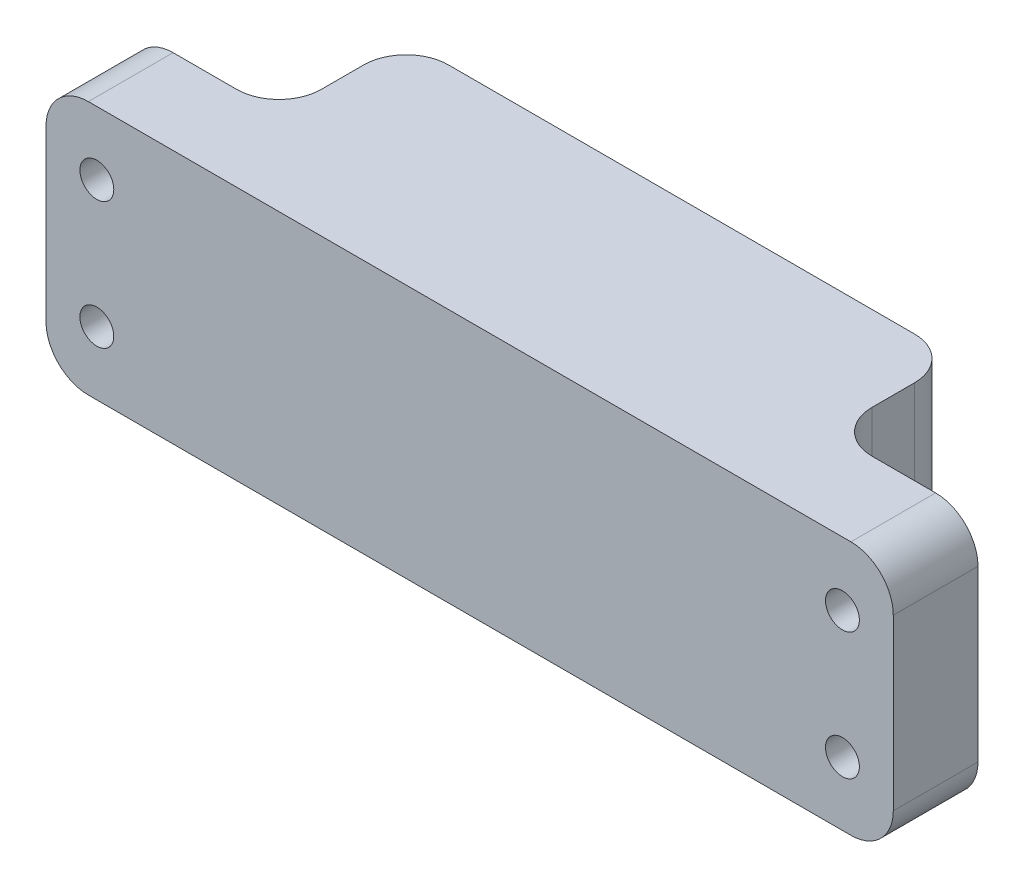
ISO-10303-21;
HEADER;
FILE_DESCRIPTION(('STEP AP214'),'2;1');
FILE_NAME('part.step','',(''),(''),'','','');
FILE_SCHEMA(('AUTOMOTIVE_DESIGN { 1 0 10303 214 1 1 1 1 }'));
ENDSEC;
DATA;
#1=APPLICATION_CONTEXT('core data for automotive mechanical design processes');
#2=APPLICATION_PROTOCOL_DEFINITION('international standard','automotive_design',2000,#1);
#3=PRODUCT_CONTEXT('',#1,'mechanical');
#4=PRODUCT('Part','Part','',(#3));
#5=PRODUCT_RELATED_PRODUCT_CATEGORY('part','',(#4));
#6=PRODUCT_DEFINITION_FORMATION('','',#4);
#7=PRODUCT_DEFINITION_CONTEXT('part definition',#1,'design');
#8=PRODUCT_DEFINITION('design','',#6,#7);
#9=PRODUCT_DEFINITION_SHAPE('','',#8);
#10=(LENGTH_UNIT() NAMED_UNIT(*) SI_UNIT(.MILLI.,.METRE.));
#11=(NAMED_UNIT(*) PLANE_ANGLE_UNIT() SI_UNIT($,.RADIAN.));
#12=(NAMED_UNIT(*) SI_UNIT($,.STERADIAN.) SOLID_ANGLE_UNIT());
#13=UNCERTAINTY_MEASURE_WITH_UNIT(LENGTH_MEASURE(1.E-05),#10,'distance_accuracy_value','');
#14=(GEOMETRIC_REPRESENTATION_CONTEXT(3) GLOBAL_UNCERTAINTY_ASSIGNED_CONTEXT((#13)) GLOBAL_UNIT_ASSIGNED_CONTEXT((#10,
#11,#12)) REPRESENTATION_CONTEXT('',''));
#15=CARTESIAN_POINT('',(0.,0.,0.));
#16=DIRECTION('',(0.,0.,1.));
#17=DIRECTION('',(1.,0.,0.));
#18=AXIS2_PLACEMENT_3D('',#15,#16,#17);
#19=CARTESIAN_POINT('',(88.,45.,25.0000000000001));
#20=DIRECTION('',(0.,0.,-1.));
#21=DIRECTION('',(-1.,0.,0.));
#22=AXIS2_PLACEMENT_3D('',#19,#20,#21);
#23=CYLINDRICAL_SURFACE('',#22,4.00000000000001);
#24=CARTESIAN_POINT('',(88.,45.,25.0000000000001));
#25=DIRECTION('',(0.,0.,-1.));
#26=DIRECTION('',(-1.,0.,0.));
#27=AXIS2_PLACEMENT_3D('',#24,#25,#26);
#28=CIRCLE('',#27,4.00000000000001);
#29=CARTESIAN_POINT('',(84.,45.,25.0000000000001));
#30=VERTEX_POINT('',#29);
#31=EDGE_CURVE('E297',#30,#30,#28,.T.);
#32=ORIENTED_EDGE('',*,*,#31,.F.);
#33=EDGE_LOOP('',(#32));
#34=FACE_BOUND('',#33,.T.);
#35=CARTESIAN_POINT('',(88.,45.,15.));
#36=DIRECTION('',(0.,0.,-1.));
#37=DIRECTION('',(-1.,0.,0.));
#38=AXIS2_PLACEMENT_3D('',#35,#36,#37);
#39=CIRCLE('',#38,4.00000000000001);
#40=CARTESIAN_POINT('',(84.,45.,15.));
#41=VERTEX_POINT('',#40);
#42=EDGE_CURVE('E637',#41,#41,#39,.T.);
#43=ORIENTED_EDGE('',*,*,#42,.T.);
#44=EDGE_LOOP('',(#43));
#45=FACE_BOUND('',#44,.T.);
#46=ADVANCED_FACE('F50',(#34,#45),#23,.F.);
#47=CARTESIAN_POINT('',(88.,15.,25.0000000000001));
#48=DIRECTION('',(0.,0.,-1.));
#49=DIRECTION('',(-1.,0.,0.));
#50=AXIS2_PLACEMENT_3D('',#47,#48,#49);
#51=CYLINDRICAL_SURFACE('',#50,4.00000000000001);
#52=CARTESIAN_POINT('',(88.,15.,25.0000000000001));
#53=DIRECTION('',(0.,0.,-1.));
#54=DIRECTION('',(1.,0.,0.));
#55=AXIS2_PLACEMENT_3D('',#52,#53,#54);
#56=CIRCLE('',#55,4.00000000000001);
#57=CARTESIAN_POINT('',(92.,15.,25.0000000000001));
#58=VERTEX_POINT('',#57);
#59=EDGE_CURVE('E687',#58,#58,#56,.T.);
#60=ORIENTED_EDGE('',*,*,#59,.F.);
#61=EDGE_LOOP('',(#60));
#62=FACE_BOUND('',#61,.T.);
#63=CARTESIAN_POINT('',(88.,15.,15.));
#64=DIRECTION('',(0.,0.,-1.));
#65=DIRECTION('',(-1.,0.,0.));
#66=AXIS2_PLACEMENT_3D('',#63,#64,#65);
#67=CIRCLE('',#66,4.00000000000001);
#68=CARTESIAN_POINT('',(84.,15.,15.));
#69=VERTEX_POINT('',#68);
#70=EDGE_CURVE('E660',#69,#69,#67,.T.);
#71=ORIENTED_EDGE('',*,*,#70,.T.);
#72=EDGE_LOOP('',(#71));
#73=FACE_BOUND('',#72,.T.);
#74=ADVANCED_FACE('F384',(#62,#73),#51,.F.);
#75=CARTESIAN_POINT('',(-88.,15.,25.));
#76=DIRECTION('',(0.,0.,-1.));
#77=DIRECTION('',(-1.,0.,0.));
#78=AXIS2_PLACEMENT_3D('',#75,#76,#77);
#79=CYLINDRICAL_SURFACE('',#78,4.00000000000001);
#80=CARTESIAN_POINT('',(-88.,15.,25.));
#81=DIRECTION('',(0.,0.,-1.));
#82=DIRECTION('',(-1.,0.,0.));
#83=AXIS2_PLACEMENT_3D('',#80,#81,#82);
#84=CIRCLE('',#83,4.00000000000001);
#85=CARTESIAN_POINT('',(-92.,15.,25.));
#86=VERTEX_POINT('',#85);
#87=EDGE_CURVE('E691',#86,#86,#84,.T.);
#88=ORIENTED_EDGE('',*,*,#87,.F.);
#89=EDGE_LOOP('',(#88));
#90=FACE_BOUND('',#89,.T.);
#91=CARTESIAN_POINT('',(-88.,15.,15.));
#92=DIRECTION('',(0.,0.,-1.));
#93=DIRECTION('',(-1.,0.,0.));
#94=AXIS2_PLACEMENT_3D('',#91,#92,#93);
#95=CIRCLE('',#94,4.00000000000001);
#96=CARTESIAN_POINT('',(-92.,15.,15.));
#97=VERTEX_POINT('',#96);
#98=EDGE_CURVE('E664',#97,#97,#95,.T.);
#99=ORIENTED_EDGE('',*,*,#98,.T.);
#100=EDGE_LOOP('',(#99));
#101=FACE_BOUND('',#100,.T.);
#102=ADVANCED_FACE('F390',(#90,#101),#79,.F.);
#103=CARTESIAN_POINT('',(-88.,45.,25.));
#104=DIRECTION('',(0.,0.,-1.));
#105=DIRECTION('',(-1.,0.,0.));
#106=AXIS2_PLACEMENT_3D('',#103,#104,#105);
#107=CYLINDRICAL_SURFACE('',#106,4.00000000000001);
#108=CARTESIAN_POINT('',(-88.,45.,25.));
#109=DIRECTION('',(0.,0.,-1.));
#110=DIRECTION('',(1.,0.,0.));
#111=AXIS2_PLACEMENT_3D('',#108,#109,#110);
#112=CIRCLE('',#111,4.00000000000001);
#113=CARTESIAN_POINT('',(-84.,45.,25.));
#114=VERTEX_POINT('',#113);
#115=EDGE_CURVE('E683',#114,#114,#112,.T.);
#116=ORIENTED_EDGE('',*,*,#115,.F.);
#117=EDGE_LOOP('',(#116));
#118=FACE_BOUND('',#117,.T.);
#119=CARTESIAN_POINT('',(-88.,45.,15.));
#120=DIRECTION('',(0.,0.,-1.));
#121=DIRECTION('',(-1.,0.,0.));
#122=AXIS2_PLACEMENT_3D('',#119,#120,#121);
#123=CIRCLE('',#122,4.00000000000001);
#124=CARTESIAN_POINT('',(-92.,45.,15.));
#125=VERTEX_POINT('',#124);
#126=EDGE_CURVE('E655',#125,#125,#123,.T.);
#127=ORIENTED_EDGE('',*,*,#126,.T.);
#128=EDGE_LOOP('',(#127));
#129=FACE_BOUND('',#128,.T.);
#130=ADVANCED_FACE('F397',(#118,#129),#107,.F.);
#131=CARTESIAN_POINT('',(0.,60.,4.99999999999995));
#132=DIRECTION('',(0.,0.,-1.));
#133=DIRECTION('',(-1.,0.,0.));
#134=AXIS2_PLACEMENT_3D('',#131,#132,#133);
#135=PLANE('',#134);
#136=CARTESIAN_POINT('',(88.,15.,4.99999999999999));
#137=DIRECTION('',(0.,0.,-1.));
#138=DIRECTION('',(-1.,0.,0.));
#139=AXIS2_PLACEMENT_3D('',#136,#137,#138);
#140=CIRCLE('',#139,6.00000000000001);
#141=CARTESIAN_POINT('',(82.,15.,4.99999999999999));
#142=VERTEX_POINT('',#141);
#143=EDGE_CURVE('E665',#142,#142,#140,.T.);
#144=ORIENTED_EDGE('',*,*,#143,.F.);
#145=EDGE_LOOP('',(#144));
#146=FACE_BOUND('',#145,.T.);
#147=CARTESIAN_POINT('',(88.,45.,4.99999999999999));
#148=DIRECTION('',(0.,0.,-1.));
#149=DIRECTION('',(-1.,0.,0.));
#150=AXIS2_PLACEMENT_3D('',#147,#148,#149);
#151=CIRCLE('',#150,6.00000000000001);
#152=CARTESIAN_POINT('',(82.,45.,4.99999999999999));
#153=VERTEX_POINT('',#152);
#154=EDGE_CURVE('E642',#153,#153,#151,.T.);
#155=ORIENTED_EDGE('',*,*,#154,.F.);
#156=EDGE_LOOP('',(#155));
#157=FACE_BOUND('',#156,.T.);
#158=DIRECTION('',(0.,-1.,0.));
#159=VECTOR('',#158,1.);
#160=CARTESIAN_POINT('',(100.,60.,4.99999999999998));
#161=LINE('',#160,#159);
#162=CARTESIAN_POINT('',(100.,50.,4.99999999999998));
#163=VERTEX_POINT('',#162);
#164=CARTESIAN_POINT('',(100.,10.,4.99999999999998));
#165=VERTEX_POINT('',#164);
#166=EDGE_CURVE('E332',#163,#165,#161,.T.);
#167=ORIENTED_EDGE('',*,*,#166,.T.);
#168=CARTESIAN_POINT('',(90.,10.,4.99999999999999));
#169=DIRECTION('',(0.,0.,-1.));
#170=DIRECTION('',(-1.,0.,0.));
#171=AXIS2_PLACEMENT_3D('',#168,#169,#170);
#172=CIRCLE('',#171,10.);
#173=CARTESIAN_POINT('',(90.,0.,4.99999999999999));
#174=VERTEX_POINT('',#173);
#175=EDGE_CURVE('E66',#165,#174,#172,.T.);
#176=ORIENTED_EDGE('',*,*,#175,.T.);
#177=DIRECTION('',(1.,0.,0.));
#178=VECTOR('',#177,1.);
#179=CARTESIAN_POINT('',(0.,0.,4.99999999999995));
#180=LINE('',#179,#178);
#181=CARTESIAN_POINT('',(75.,0.,4.99999999999998));
#182=VERTEX_POINT('',#181);
#183=EDGE_CURVE('E288',#182,#174,#180,.T.);
#184=ORIENTED_EDGE('',*,*,#183,.F.);
#185=DIRECTION('',(0.,-1.,0.));
#186=VECTOR('',#185,1.);
#187=CARTESIAN_POINT('',(75.,60.,4.99999999999998));
#188=LINE('',#187,#186);
#189=CARTESIAN_POINT('',(75.,60.,4.99999999999998));
#190=VERTEX_POINT('',#189);
#191=EDGE_CURVE('E270',#182,#190,#188,.F.);
#192=ORIENTED_EDGE('',*,*,#191,.T.);
#193=DIRECTION('',(1.,0.,0.));
#194=VECTOR('',#193,1.);
#195=CARTESIAN_POINT('',(0.,60.,4.99999999999995));
#196=LINE('',#195,#194);
#197=CARTESIAN_POINT('',(90.,60.,4.99999999999999));
#198=VERTEX_POINT('',#197);
#199=EDGE_CURVE('E307',#190,#198,#196,.T.);
#200=ORIENTED_EDGE('',*,*,#199,.T.);
#201=CARTESIAN_POINT('',(90.,50.,4.99999999999999));
#202=DIRECTION('',(0.,0.,-1.));
#203=DIRECTION('',(-1.,0.,0.));
#204=AXIS2_PLACEMENT_3D('',#201,#202,#203);
#205=CIRCLE('',#204,10.);
#206=EDGE_CURVE('E74',#198,#163,#205,.T.);
#207=ORIENTED_EDGE('',*,*,#206,.T.);
#208=EDGE_LOOP('',(#167,#176,#184,#192,#200,#207));
#209=FACE_BOUND('',#208,.T.);
#210=ADVANCED_FACE('F294',(#146,#157,#209),#135,.T.);
#211=CARTESIAN_POINT('',(65.,60.,0.));
#212=DIRECTION('',(1.,0.,0.));
#213=DIRECTION('',(0.,0.,-1.));
#214=AXIS2_PLACEMENT_3D('',#211,#212,#213);
#215=PLANE('',#214);
#216=DIRECTION('',(0.,0.,1.));
#217=VECTOR('',#216,1.);
#218=CARTESIAN_POINT('',(65.,0.,0.));
#219=LINE('',#218,#217);
#220=CARTESIAN_POINT('',(65.,0.,-15.));
#221=VERTEX_POINT('',#220);
#222=CARTESIAN_POINT('',(65.,0.,-5.00000000000002));
#223=VERTEX_POINT('',#222);
#224=EDGE_CURVE('E290',#221,#223,#219,.T.);
#225=ORIENTED_EDGE('',*,*,#224,.F.);
#226=DIRECTION('',(0.,-1.,0.));
#227=VECTOR('',#226,1.);
#228=CARTESIAN_POINT('',(65.,60.,-15.));
#229=LINE('',#228,#227);
#230=CARTESIAN_POINT('',(65.,60.,-15.));
#231=VERTEX_POINT('',#230);
#232=EDGE_CURVE('E178',#221,#231,#229,.F.);
#233=ORIENTED_EDGE('',*,*,#232,.T.);
#234=DIRECTION('',(0.,0.,1.));
#235=VECTOR('',#234,1.);
#236=CARTESIAN_POINT('',(65.,60.,0.));
#237=LINE('',#236,#235);
#238=CARTESIAN_POINT('',(65.,60.,-5.00000000000002));
#239=VERTEX_POINT('',#238);
#240=EDGE_CURVE('E305',#231,#239,#237,.T.);
#241=ORIENTED_EDGE('',*,*,#240,.T.);
#242=DIRECTION('',(0.,-1.,0.));
#243=VECTOR('',#242,1.);
#244=CARTESIAN_POINT('',(65.,0.,-5.00000000000002));
#245=LINE('',#244,#243);
#246=EDGE_CURVE('E277',#239,#223,#245,.T.);
#247=ORIENTED_EDGE('',*,*,#246,.T.);
#248=EDGE_LOOP('',(#225,#233,#241,#247));
#249=FACE_BOUND('',#248,.T.);
#250=ADVANCED_FACE('F309',(#249),#215,.T.);
#251=CARTESIAN_POINT('',(0.,60.,-25.));
#252=DIRECTION('',(0.,0.,-1.));
#253=DIRECTION('',(-1.,0.,0.));
#254=AXIS2_PLACEMENT_3D('',#251,#252,#253);
#255=PLANE('',#254);
#256=DIRECTION('',(1.,0.,0.));
#257=VECTOR('',#256,1.);
#258=CARTESIAN_POINT('',(0.,0.,-25.));
#259=LINE('',#258,#257);
#260=CARTESIAN_POINT('',(-55.,0.,-25.));
#261=VERTEX_POINT('',#260);
#262=CARTESIAN_POINT('',(55.,0.,-25.));
#263=VERTEX_POINT('',#262);
#264=EDGE_CURVE('E189',#261,#263,#259,.T.);
#265=ORIENTED_EDGE('',*,*,#264,.F.);
#266=DIRECTION('',(0.,-1.,0.));
#267=VECTOR('',#266,1.);
#268=CARTESIAN_POINT('',(-55.,60.,-25.));
#269=LINE('',#268,#267);
#270=CARTESIAN_POINT('',(-55.,60.,-25.));
#271=VERTEX_POINT('',#270);
#272=EDGE_CURVE('E220',#261,#271,#269,.F.);
#273=ORIENTED_EDGE('',*,*,#272,.T.);
#274=DIRECTION('',(1.,0.,0.));
#275=VECTOR('',#274,1.);
#276=CARTESIAN_POINT('',(0.,60.,-25.));
#277=LINE('',#276,#275);
#278=CARTESIAN_POINT('',(55.,60.,-25.));
#279=VERTEX_POINT('',#278);
#280=EDGE_CURVE('E312',#271,#279,#277,.T.);
#281=ORIENTED_EDGE('',*,*,#280,.T.);
#282=DIRECTION('',(0.,-1.,0.));
#283=VECTOR('',#282,1.);
#284=CARTESIAN_POINT('',(55.,60.,-25.));
#285=LINE('',#284,#283);
#286=EDGE_CURVE('E216',#279,#263,#285,.T.);
#287=ORIENTED_EDGE('',*,*,#286,.T.);
#288=EDGE_LOOP('',(#265,#273,#281,#287));
#289=FACE_BOUND('',#288,.T.);
#290=ADVANCED_FACE('F435',(#289),#255,.T.);
#291=CARTESIAN_POINT('',(-65.,60.,0.));
#292=DIRECTION('',(-1.,0.,0.));
#293=DIRECTION('',(0.,0.,1.));
#294=AXIS2_PLACEMENT_3D('',#291,#292,#293);
#295=PLANE('',#294);
#296=DIRECTION('',(0.,0.,-1.));
#297=VECTOR('',#296,1.);
#298=CARTESIAN_POINT('',(-65.,60.,0.));
#299=LINE('',#298,#297);
#300=CARTESIAN_POINT('',(-65.,60.,-5.00000000000001));
#301=VERTEX_POINT('',#300);
#302=CARTESIAN_POINT('',(-65.,60.,-15.));
#303=VERTEX_POINT('',#302);
#304=EDGE_CURVE('E317',#301,#303,#299,.T.);
#305=ORIENTED_EDGE('',*,*,#304,.T.);
#306=DIRECTION('',(0.,-1.,0.));
#307=VECTOR('',#306,1.);
#308=CARTESIAN_POINT('',(-65.,60.,-15.));
#309=LINE('',#308,#307);
#310=CARTESIAN_POINT('',(-65.,0.,-15.));
#311=VERTEX_POINT('',#310);
#312=EDGE_CURVE('E187',#303,#311,#309,.T.);
#313=ORIENTED_EDGE('',*,*,#312,.T.);
#314=DIRECTION('',(0.,0.,-1.));
#315=VECTOR('',#314,1.);
#316=CARTESIAN_POINT('',(-65.,0.,0.));
#317=LINE('',#316,#315);
#318=CARTESIAN_POINT('',(-65.,0.,-5.00000000000001));
#319=VERTEX_POINT('',#318);
#320=EDGE_CURVE('E168',#319,#311,#317,.T.);
#321=ORIENTED_EDGE('',*,*,#320,.F.);
#322=DIRECTION('',(0.,-1.,0.));
#323=VECTOR('',#322,1.);
#324=CARTESIAN_POINT('',(-65.,60.,-5.00000000000001));
#325=LINE('',#324,#323);
#326=EDGE_CURVE('E184',#319,#301,#325,.F.);
#327=ORIENTED_EDGE('',*,*,#326,.T.);
#328=EDGE_LOOP('',(#305,#313,#321,#327));
#329=FACE_BOUND('',#328,.T.);
#330=ADVANCED_FACE('F183',(#329),#295,.T.);
#331=CARTESIAN_POINT('',(0.,60.,4.99999999999999));
#332=DIRECTION('',(0.,0.,-1.));
#333=DIRECTION('',(-1.,0.,0.));
#334=AXIS2_PLACEMENT_3D('',#331,#332,#333);
#335=PLANE('',#334);
#336=CARTESIAN_POINT('',(-88.,45.,4.99999999999999));
#337=DIRECTION('',(0.,0.,-1.));
#338=DIRECTION('',(-1.,0.,0.));
#339=AXIS2_PLACEMENT_3D('',#336,#337,#338);
#340=CIRCLE('',#339,6.00000000000001);
#341=CARTESIAN_POINT('',(-94.,45.,4.99999999999999));
#342=VERTEX_POINT('',#341);
#343=EDGE_CURVE('E651',#342,#342,#340,.T.);
#344=ORIENTED_EDGE('',*,*,#343,.F.);
#345=EDGE_LOOP('',(#344));
#346=FACE_BOUND('',#345,.T.);
#347=CARTESIAN_POINT('',(-88.,15.,4.99999999999999));
#348=DIRECTION('',(0.,0.,-1.));
#349=DIRECTION('',(-1.,0.,0.));
#350=AXIS2_PLACEMENT_3D('',#347,#348,#349);
#351=CIRCLE('',#350,6.00000000000001);
#352=CARTESIAN_POINT('',(-94.,15.,4.99999999999999));
#353=VERTEX_POINT('',#352);
#354=EDGE_CURVE('E678',#353,#353,#351,.T.);
#355=ORIENTED_EDGE('',*,*,#354,.F.);
#356=EDGE_LOOP('',(#355));
#357=FACE_BOUND('',#356,.T.);
#358=DIRECTION('',(1.,0.,0.));
#359=VECTOR('',#358,1.);
#360=CARTESIAN_POINT('',(0.,0.,4.99999999999999));
#361=LINE('',#360,#359);
#362=CARTESIAN_POINT('',(-90.,0.,4.99999999999999));
#363=VERTEX_POINT('',#362);
#364=CARTESIAN_POINT('',(-75.,0.,4.99999999999999));
#365=VERTEX_POINT('',#364);
#366=EDGE_CURVE('E171',#363,#365,#361,.T.);
#367=ORIENTED_EDGE('',*,*,#366,.F.);
#368=CARTESIAN_POINT('',(-90.,10.,4.99999999999999));
#369=DIRECTION('',(0.,0.,-1.));
#370=DIRECTION('',(-1.,0.,0.));
#371=AXIS2_PLACEMENT_3D('',#368,#369,#370);
#372=CIRCLE('',#371,10.);
#373=CARTESIAN_POINT('',(-100.,10.,4.99999999999999));
#374=VERTEX_POINT('',#373);
#375=EDGE_CURVE('E242',#363,#374,#372,.T.);
#376=ORIENTED_EDGE('',*,*,#375,.T.);
#377=DIRECTION('',(0.,-1.,0.));
#378=VECTOR('',#377,1.);
#379=CARTESIAN_POINT('',(-100.,60.,4.99999999999999));
#380=LINE('',#379,#378);
#381=CARTESIAN_POINT('',(-100.,50.,4.99999999999999));
#382=VERTEX_POINT('',#381);
#383=EDGE_CURVE('E194',#382,#374,#380,.T.);
#384=ORIENTED_EDGE('',*,*,#383,.F.);
#385=CARTESIAN_POINT('',(-90.,50.,4.99999999999999));
#386=DIRECTION('',(0.,0.,-1.));
#387=DIRECTION('',(-1.,0.,0.));
#388=AXIS2_PLACEMENT_3D('',#385,#386,#387);
#389=CIRCLE('',#388,10.);
#390=CARTESIAN_POINT('',(-90.,60.,4.99999999999999));
#391=VERTEX_POINT('',#390);
#392=EDGE_CURVE('E236',#382,#391,#389,.T.);
#393=ORIENTED_EDGE('',*,*,#392,.T.);
#394=DIRECTION('',(1.,0.,0.));
#395=VECTOR('',#394,1.);
#396=CARTESIAN_POINT('',(0.,60.,4.99999999999999));
#397=LINE('',#396,#395);
#398=CARTESIAN_POINT('',(-75.,60.,4.99999999999999));
#399=VERTEX_POINT('',#398);
#400=EDGE_CURVE('E325',#391,#399,#397,.T.);
#401=ORIENTED_EDGE('',*,*,#400,.T.);
#402=DIRECTION('',(0.,-1.,0.));
#403=VECTOR('',#402,1.);
#404=CARTESIAN_POINT('',(-75.,0.,4.99999999999999));
#405=LINE('',#404,#403);
#406=EDGE_CURVE('E239',#399,#365,#405,.T.);
#407=ORIENTED_EDGE('',*,*,#406,.T.);
#408=EDGE_LOOP('',(#367,#376,#384,#393,#401,#407));
#409=FACE_BOUND('',#408,.T.);
#410=ADVANCED_FACE('F365',(#346,#357,#409),#335,.T.);
#411=CARTESIAN_POINT('',(-100.,60.,0.));
#412=DIRECTION('',(-1.,0.,0.));
#413=DIRECTION('',(0.,0.,1.));
#414=AXIS2_PLACEMENT_3D('',#411,#412,#413);
#415=PLANE('',#414);
#416=ORIENTED_EDGE('',*,*,#383,.T.);
#417=DIRECTION('',(0.,0.,-1.));
#418=VECTOR('',#417,1.);
#419=CARTESIAN_POINT('',(-100.,10.,25.));
#420=LINE('',#419,#418);
#421=CARTESIAN_POINT('',(-100.,10.,25.));
#422=VERTEX_POINT('',#421);
#423=EDGE_CURVE('E249',#374,#422,#420,.F.);
#424=ORIENTED_EDGE('',*,*,#423,.T.);
#425=DIRECTION('',(0.,-1.,0.));
#426=VECTOR('',#425,1.);
#427=CARTESIAN_POINT('',(-100.,60.,25.));
#428=LINE('',#427,#426);
#429=CARTESIAN_POINT('',(-100.,50.,25.));
#430=VERTEX_POINT('',#429);
#431=EDGE_CURVE('E201',#430,#422,#428,.T.);
#432=ORIENTED_EDGE('',*,*,#431,.F.);
#433=DIRECTION('',(0.,0.,-1.));
#434=VECTOR('',#433,1.);
#435=CARTESIAN_POINT('',(-100.,50.,0.));
#436=LINE('',#435,#434);
#437=EDGE_CURVE('E245',#430,#382,#436,.T.);
#438=ORIENTED_EDGE('',*,*,#437,.T.);
#439=EDGE_LOOP('',(#416,#424,#432,#438));
#440=FACE_BOUND('',#439,.T.);
#441=ADVANCED_FACE('F371',(#440),#415,.T.);
#442=CARTESIAN_POINT('',(0.,60.,25.));
#443=DIRECTION('',(0.,0.,-1.));
#444=DIRECTION('',(-1.,0.,0.));
#445=AXIS2_PLACEMENT_3D('',#442,#443,#444);
#446=PLANE('',#445);
#447=ORIENTED_EDGE('',*,*,#115,.T.);
#448=EDGE_LOOP('',(#447));
#449=FACE_BOUND('',#448,.T.);
#450=ORIENTED_EDGE('',*,*,#87,.T.);
#451=EDGE_LOOP('',(#450));
#452=FACE_BOUND('',#451,.T.);
#453=ORIENTED_EDGE('',*,*,#59,.T.);
#454=EDGE_LOOP('',(#453));
#455=FACE_BOUND('',#454,.T.);
#456=ORIENTED_EDGE('',*,*,#31,.T.);
#457=EDGE_LOOP('',(#456));
#458=FACE_BOUND('',#457,.T.);
#459=ORIENTED_EDGE('',*,*,#431,.T.);
#460=CARTESIAN_POINT('',(-90.,10.,25.));
#461=DIRECTION('',(0.,0.,-1.));
#462=DIRECTION('',(-1.,0.,0.));
#463=AXIS2_PLACEMENT_3D('',#460,#461,#462);
#464=CIRCLE('',#463,10.);
#465=CARTESIAN_POINT('',(-90.,0.,25.));
#466=VERTEX_POINT('',#465);
#467=EDGE_CURVE('E261',#422,#466,#464,.F.);
#468=ORIENTED_EDGE('',*,*,#467,.T.);
#469=DIRECTION('',(1.,0.,0.));
#470=VECTOR('',#469,1.);
#471=CARTESIAN_POINT('',(0.,0.,25.));
#472=LINE('',#471,#470);
#473=CARTESIAN_POINT('',(90.,0.,25.));
#474=VERTEX_POINT('',#473);
#475=EDGE_CURVE('E319',#466,#474,#472,.T.);
#476=ORIENTED_EDGE('',*,*,#475,.T.);
#477=CARTESIAN_POINT('',(90.,10.,25.));
#478=DIRECTION('',(0.,0.,-1.));
#479=DIRECTION('',(-1.,0.,0.));
#480=AXIS2_PLACEMENT_3D('',#477,#478,#479);
#481=CIRCLE('',#480,10.);
#482=CARTESIAN_POINT('',(100.,10.,25.));
#483=VERTEX_POINT('',#482);
#484=EDGE_CURVE('E255',#474,#483,#481,.F.);
#485=ORIENTED_EDGE('',*,*,#484,.T.);
#486=DIRECTION('',(0.,-1.,0.));
#487=VECTOR('',#486,1.);
#488=CARTESIAN_POINT('',(100.,60.,25.));
#489=LINE('',#488,#487);
#490=CARTESIAN_POINT('',(100.,50.,25.));
#491=VERTEX_POINT('',#490);
#492=EDGE_CURVE('E346',#491,#483,#489,.T.);
#493=ORIENTED_EDGE('',*,*,#492,.F.);
#494=CARTESIAN_POINT('',(90.,50.,25.));
#495=DIRECTION('',(0.,0.,-1.));
#496=DIRECTION('',(-1.,0.,0.));
#497=AXIS2_PLACEMENT_3D('',#494,#495,#496);
#498=CIRCLE('',#497,10.);
#499=CARTESIAN_POINT('',(90.,60.,25.));
#500=VERTEX_POINT('',#499);
#501=EDGE_CURVE('E252',#491,#500,#498,.F.);
#502=ORIENTED_EDGE('',*,*,#501,.T.);
#503=DIRECTION('',(1.,0.,0.));
#504=VECTOR('',#503,1.);
#505=CARTESIAN_POINT('',(0.,60.,25.));
#506=LINE('',#505,#504);
#507=CARTESIAN_POINT('',(-90.,60.,25.));
#508=VERTEX_POINT('',#507);
#509=EDGE_CURVE('E329',#508,#500,#506,.T.);
#510=ORIENTED_EDGE('',*,*,#509,.F.);
#511=CARTESIAN_POINT('',(-90.,50.,25.));
#512=DIRECTION('',(0.,0.,-1.));
#513=DIRECTION('',(-1.,0.,0.));
#514=AXIS2_PLACEMENT_3D('',#511,#512,#513);
#515=CIRCLE('',#514,10.);
#516=EDGE_CURVE('E258',#508,#430,#515,.F.);
#517=ORIENTED_EDGE('',*,*,#516,.T.);
#518=EDGE_LOOP('',(#459,#468,#476,#485,#493,#502,#510,#517));
#519=FACE_BOUND('',#518,.T.);
#520=ADVANCED_FACE('F354',(#449,#452,#455,#458,#519),#446,.F.);
#521=CARTESIAN_POINT('',(100.,60.,0.));
#522=DIRECTION('',(-1.,0.,0.));
#523=DIRECTION('',(0.,0.,1.));
#524=AXIS2_PLACEMENT_3D('',#521,#522,#523);
#525=PLANE('',#524);
#526=ORIENTED_EDGE('',*,*,#492,.T.);
#527=DIRECTION('',(0.,0.,-1.));
#528=VECTOR('',#527,1.);
#529=CARTESIAN_POINT('',(100.,10.,0.));
#530=LINE('',#529,#528);
#531=EDGE_CURVE('E267',#483,#165,#530,.T.);
#532=ORIENTED_EDGE('',*,*,#531,.T.);
#533=ORIENTED_EDGE('',*,*,#166,.F.);
#534=DIRECTION('',(0.,0.,-1.));
#535=VECTOR('',#534,1.);
#536=CARTESIAN_POINT('',(100.,50.,25.));
#537=LINE('',#536,#535);
#538=EDGE_CURVE('E264',#163,#491,#537,.F.);
#539=ORIENTED_EDGE('',*,*,#538,.T.);
#540=EDGE_LOOP('',(#526,#532,#533,#539));
#541=FACE_BOUND('',#540,.T.);
#542=ADVANCED_FACE('F378',(#541),#525,.F.);
#543=CARTESIAN_POINT('',(0.,60.,0.));
#544=DIRECTION('',(0.,1.,0.));
#545=DIRECTION('',(0.,0.,1.));
#546=AXIS2_PLACEMENT_3D('',#543,#544,#545);
#547=PLANE('',#546);
#548=ORIENTED_EDGE('',*,*,#280,.F.);
#549=CARTESIAN_POINT('',(-55.,60.,-15.));
#550=DIRECTION('',(0.,1.,0.));
#551=DIRECTION('',(0.,0.,1.));
#552=AXIS2_PLACEMENT_3D('',#549,#550,#551);
#553=CIRCLE('',#552,10.);
#554=EDGE_CURVE('E233',#271,#303,#553,.T.);
#555=ORIENTED_EDGE('',*,*,#554,.T.);
#556=ORIENTED_EDGE('',*,*,#304,.F.);
#557=CARTESIAN_POINT('',(-75.,60.,-5.00000000000001));
#558=DIRECTION('',(0.,1.,0.));
#559=DIRECTION('',(0.,0.,1.));
#560=AXIS2_PLACEMENT_3D('',#557,#558,#559);
#561=CIRCLE('',#560,10.);
#562=EDGE_CURVE('E177',#301,#399,#561,.F.);
#563=ORIENTED_EDGE('',*,*,#562,.T.);
#564=ORIENTED_EDGE('',*,*,#400,.F.);
#565=DIRECTION('',(0.,0.,-1.));
#566=VECTOR('',#565,1.);
#567=CARTESIAN_POINT('',(-90.,60.,0.));
#568=LINE('',#567,#566);
#569=EDGE_CURVE('E230',#391,#508,#568,.F.);
#570=ORIENTED_EDGE('',*,*,#569,.T.);
#571=ORIENTED_EDGE('',*,*,#509,.T.);
#572=DIRECTION('',(0.,0.,-1.));
#573=VECTOR('',#572,1.);
#574=CARTESIAN_POINT('',(90.,60.,4.99999999999998));
#575=LINE('',#574,#573);
#576=EDGE_CURVE('E226',#500,#198,#575,.T.);
#577=ORIENTED_EDGE('',*,*,#576,.T.);
#578=ORIENTED_EDGE('',*,*,#199,.F.);
#579=CARTESIAN_POINT('',(75.,60.,-5.00000000000002));
#580=DIRECTION('',(0.,1.,0.));
#581=DIRECTION('',(0.,0.,1.));
#582=AXIS2_PLACEMENT_3D('',#579,#580,#581);
#583=CIRCLE('',#582,10.);
#584=EDGE_CURVE('E12',#190,#239,#583,.F.);
#585=ORIENTED_EDGE('',*,*,#584,.T.);
#586=ORIENTED_EDGE('',*,*,#240,.F.);
#587=CARTESIAN_POINT('',(55.,60.,-15.));
#588=DIRECTION('',(0.,1.,0.));
#589=DIRECTION('',(0.,0.,1.));
#590=AXIS2_PLACEMENT_3D('',#587,#588,#589);
#591=CIRCLE('',#590,10.);
#592=EDGE_CURVE('E223',#231,#279,#591,.T.);
#593=ORIENTED_EDGE('',*,*,#592,.T.);
#594=EDGE_LOOP('',(#548,#555,#556,#563,#564,#570,#571,#577,#578,#585,#586,#593));
#595=FACE_BOUND('',#594,.T.);
#596=ADVANCED_FACE('F304',(#595),#547,.T.);
#597=CARTESIAN_POINT('',(0.,0.,0.));
#598=DIRECTION('',(0.,1.,0.));
#599=DIRECTION('',(0.,0.,1.));
#600=AXIS2_PLACEMENT_3D('',#597,#598,#599);
#601=PLANE('',#600);
#602=ORIENTED_EDGE('',*,*,#320,.T.);
#603=CARTESIAN_POINT('',(-55.,0.,-15.));
#604=DIRECTION('',(0.,1.,0.));
#605=DIRECTION('',(0.,0.,1.));
#606=AXIS2_PLACEMENT_3D('',#603,#604,#605);
#607=CIRCLE('',#606,10.);
#608=EDGE_CURVE('E213',#311,#261,#607,.F.);
#609=ORIENTED_EDGE('',*,*,#608,.T.);
#610=ORIENTED_EDGE('',*,*,#264,.T.);
#611=CARTESIAN_POINT('',(55.,0.,-15.));
#612=DIRECTION('',(0.,1.,0.));
#613=DIRECTION('',(0.,0.,1.));
#614=AXIS2_PLACEMENT_3D('',#611,#612,#613);
#615=CIRCLE('',#614,10.);
#616=EDGE_CURVE('E198',#263,#221,#615,.F.);
#617=ORIENTED_EDGE('',*,*,#616,.T.);
#618=ORIENTED_EDGE('',*,*,#224,.T.);
#619=CARTESIAN_POINT('',(75.,0.,-5.00000000000002));
#620=DIRECTION('',(0.,1.,0.));
#621=DIRECTION('',(0.,0.,1.));
#622=AXIS2_PLACEMENT_3D('',#619,#620,#621);
#623=CIRCLE('',#622,10.);
#624=EDGE_CURVE('E59',#223,#182,#623,.T.);
#625=ORIENTED_EDGE('',*,*,#624,.T.);
#626=ORIENTED_EDGE('',*,*,#183,.T.);
#627=DIRECTION('',(0.,0.,-1.));
#628=VECTOR('',#627,1.);
#629=CARTESIAN_POINT('',(90.,0.,0.));
#630=LINE('',#629,#628);
#631=EDGE_CURVE('E207',#174,#474,#630,.F.);
#632=ORIENTED_EDGE('',*,*,#631,.T.);
#633=ORIENTED_EDGE('',*,*,#475,.F.);
#634=DIRECTION('',(0.,0.,-1.));
#635=VECTOR('',#634,1.);
#636=CARTESIAN_POINT('',(-90.,0.,4.99999999999999));
#637=LINE('',#636,#635);
#638=EDGE_CURVE('E210',#466,#363,#637,.T.);
#639=ORIENTED_EDGE('',*,*,#638,.T.);
#640=ORIENTED_EDGE('',*,*,#366,.T.);
#641=CARTESIAN_POINT('',(-75.,0.,-5.00000000000001));
#642=DIRECTION('',(0.,1.,0.));
#643=DIRECTION('',(0.,0.,1.));
#644=AXIS2_PLACEMENT_3D('',#641,#642,#643);
#645=CIRCLE('',#644,10.);
#646=EDGE_CURVE('E165',#365,#319,#645,.T.);
#647=ORIENTED_EDGE('',*,*,#646,.T.);
#648=EDGE_LOOP('',(#602,#609,#610,#617,#618,#625,#626,#632,#633,#639,#640,#647));
#649=FACE_BOUND('',#648,.T.);
#650=ADVANCED_FACE('F167',(#649),#601,.F.);
#651=CARTESIAN_POINT('',(-55.,60.,-15.));
#652=DIRECTION('',(0.,-1.,0.));
#653=DIRECTION('',(0.,0.,-1.));
#654=AXIS2_PLACEMENT_3D('',#651,#652,#653);
#655=CYLINDRICAL_SURFACE('',#654,10.);
#656=ORIENTED_EDGE('',*,*,#554,.F.);
#657=ORIENTED_EDGE('',*,*,#272,.F.);
#658=ORIENTED_EDGE('',*,*,#608,.F.);
#659=ORIENTED_EDGE('',*,*,#312,.F.);
#660=EDGE_LOOP('',(#656,#657,#658,#659));
#661=FACE_BOUND('',#660,.T.);
#662=ADVANCED_FACE('F403',(#661),#655,.T.);
#663=CARTESIAN_POINT('',(-90.,10.,0.));
#664=DIRECTION('',(0.,0.,1.));
#665=DIRECTION('',(1.,0.,0.));
#666=AXIS2_PLACEMENT_3D('',#663,#664,#665);
#667=CYLINDRICAL_SURFACE('',#666,10.);
#668=ORIENTED_EDGE('',*,*,#467,.F.);
#669=ORIENTED_EDGE('',*,*,#423,.F.);
#670=ORIENTED_EDGE('',*,*,#375,.F.);
#671=ORIENTED_EDGE('',*,*,#638,.F.);
#672=EDGE_LOOP('',(#668,#669,#670,#671));
#673=FACE_BOUND('',#672,.T.);
#674=ADVANCED_FACE('F363',(#673),#667,.T.);
#675=CARTESIAN_POINT('',(-75.,60.,-5.00000000000001));
#676=DIRECTION('',(0.,1.,0.));
#677=DIRECTION('',(0.,0.,1.));
#678=AXIS2_PLACEMENT_3D('',#675,#676,#677);
#679=CYLINDRICAL_SURFACE('',#678,10.);
#680=ORIENTED_EDGE('',*,*,#562,.F.);
#681=ORIENTED_EDGE('',*,*,#326,.F.);
#682=ORIENTED_EDGE('',*,*,#646,.F.);
#683=ORIENTED_EDGE('',*,*,#406,.F.);
#684=EDGE_LOOP('',(#680,#681,#682,#683));
#685=FACE_BOUND('',#684,.T.);
#686=ADVANCED_FACE('F192',(#685),#679,.F.);
#687=CARTESIAN_POINT('',(-90.,50.,0.));
#688=DIRECTION('',(0.,0.,-1.));
#689=DIRECTION('',(-1.,0.,0.));
#690=AXIS2_PLACEMENT_3D('',#687,#688,#689);
#691=CYLINDRICAL_SURFACE('',#690,10.);
#692=ORIENTED_EDGE('',*,*,#516,.F.);
#693=ORIENTED_EDGE('',*,*,#569,.F.);
#694=ORIENTED_EDGE('',*,*,#392,.F.);
#695=ORIENTED_EDGE('',*,*,#437,.F.);
#696=EDGE_LOOP('',(#692,#693,#694,#695));
#697=FACE_BOUND('',#696,.T.);
#698=ADVANCED_FACE('F370',(#697),#691,.T.);
#699=CARTESIAN_POINT('',(90.,10.,0.));
#700=DIRECTION('',(0.,0.,-1.));
#701=DIRECTION('',(-1.,0.,0.));
#702=AXIS2_PLACEMENT_3D('',#699,#700,#701);
#703=CYLINDRICAL_SURFACE('',#702,10.);
#704=ORIENTED_EDGE('',*,*,#484,.F.);
#705=ORIENTED_EDGE('',*,*,#631,.F.);
#706=ORIENTED_EDGE('',*,*,#175,.F.);
#707=ORIENTED_EDGE('',*,*,#531,.F.);
#708=EDGE_LOOP('',(#704,#705,#706,#707));
#709=FACE_BOUND('',#708,.T.);
#710=ADVANCED_FACE('F412',(#709),#703,.T.);
#711=CARTESIAN_POINT('',(90.,50.,0.));
#712=DIRECTION('',(0.,0.,1.));
#713=DIRECTION('',(1.,0.,0.));
#714=AXIS2_PLACEMENT_3D('',#711,#712,#713);
#715=CYLINDRICAL_SURFACE('',#714,10.);
#716=ORIENTED_EDGE('',*,*,#501,.F.);
#717=ORIENTED_EDGE('',*,*,#538,.F.);
#718=ORIENTED_EDGE('',*,*,#206,.F.);
#719=ORIENTED_EDGE('',*,*,#576,.F.);
#720=EDGE_LOOP('',(#716,#717,#718,#719));
#721=FACE_BOUND('',#720,.T.);
#722=ADVANCED_FACE('F414',(#721),#715,.T.);
#723=CARTESIAN_POINT('',(55.,60.,-15.));
#724=DIRECTION('',(0.,-1.,0.));
#725=DIRECTION('',(0.,0.,-1.));
#726=AXIS2_PLACEMENT_3D('',#723,#724,#725);
#727=CYLINDRICAL_SURFACE('',#726,10.);
#728=ORIENTED_EDGE('',*,*,#592,.F.);
#729=ORIENTED_EDGE('',*,*,#232,.F.);
#730=ORIENTED_EDGE('',*,*,#616,.F.);
#731=ORIENTED_EDGE('',*,*,#286,.F.);
#732=EDGE_LOOP('',(#728,#729,#730,#731));
#733=FACE_BOUND('',#732,.T.);
#734=ADVANCED_FACE('F420',(#733),#727,.T.);
#735=CARTESIAN_POINT('',(75.,60.,-5.00000000000002));
#736=DIRECTION('',(0.,1.,0.));
#737=DIRECTION('',(0.,0.,1.));
#738=AXIS2_PLACEMENT_3D('',#735,#736,#737);
#739=CYLINDRICAL_SURFACE('',#738,10.);
#740=ORIENTED_EDGE('',*,*,#584,.F.);
#741=ORIENTED_EDGE('',*,*,#191,.F.);
#742=ORIENTED_EDGE('',*,*,#624,.F.);
#743=ORIENTED_EDGE('',*,*,#246,.F.);
#744=EDGE_LOOP('',(#740,#741,#742,#743));
#745=FACE_BOUND('',#744,.T.);
#746=ADVANCED_FACE('F52',(#745),#739,.F.);
#747=CARTESIAN_POINT('',(-88.,45.,15.));
#748=DIRECTION('',(0.,0.,-1.));
#749=DIRECTION('',(-1.,0.,0.));
#750=AXIS2_PLACEMENT_3D('',#747,#748,#749);
#751=CYLINDRICAL_SURFACE('',#750,6.00000000000001);
#752=CARTESIAN_POINT('',(-88.,45.,15.));
#753=DIRECTION('',(0.,0.,-1.));
#754=DIRECTION('',(-1.,0.,0.));
#755=AXIS2_PLACEMENT_3D('',#752,#753,#754);
#756=CIRCLE('',#755,6.00000000000001);
#757=CARTESIAN_POINT('',(-94.,45.,15.));
#758=VERTEX_POINT('',#757);
#759=EDGE_CURVE('E656',#758,#758,#756,.T.);
#760=ORIENTED_EDGE('',*,*,#759,.F.);
#761=EDGE_LOOP('',(#760));
#762=FACE_BOUND('',#761,.T.);
#763=ORIENTED_EDGE('',*,*,#343,.T.);
#764=EDGE_LOOP('',(#763));
#765=FACE_BOUND('',#764,.T.);
#766=ADVANCED_FACE('F430',(#762,#765),#751,.F.);
#767=CARTESIAN_POINT('',(-88.,45.,15.));
#768=DIRECTION('',(0.,0.,-1.));
#769=DIRECTION('',(-1.,0.,0.));
#770=AXIS2_PLACEMENT_3D('',#767,#768,#769);
#771=PLANE('',#770);
#772=ORIENTED_EDGE('',*,*,#126,.F.);
#773=EDGE_LOOP('',(#772));
#774=FACE_BOUND('',#773,.T.);
#775=ORIENTED_EDGE('',*,*,#759,.T.);
#776=EDGE_LOOP('',(#775));
#777=FACE_BOUND('',#776,.T.);
#778=ADVANCED_FACE('F545',(#774,#777),#771,.T.);
#779=CARTESIAN_POINT('',(-88.,15.,15.));
#780=DIRECTION('',(0.,0.,-1.));
#781=DIRECTION('',(-1.,0.,0.));
#782=AXIS2_PLACEMENT_3D('',#779,#780,#781);
#783=CYLINDRICAL_SURFACE('',#782,6.00000000000001);
#784=CARTESIAN_POINT('',(-88.,15.,15.));
#785=DIRECTION('',(0.,0.,-1.));
#786=DIRECTION('',(-1.,0.,0.));
#787=AXIS2_PLACEMENT_3D('',#784,#785,#786);
#788=CIRCLE('',#787,6.00000000000001);
#789=CARTESIAN_POINT('',(-94.,15.,15.));
#790=VERTEX_POINT('',#789);
#791=EDGE_CURVE('E679',#790,#790,#788,.T.);
#792=ORIENTED_EDGE('',*,*,#791,.F.);
#793=EDGE_LOOP('',(#792));
#794=FACE_BOUND('',#793,.T.);
#795=ORIENTED_EDGE('',*,*,#354,.T.);
#796=EDGE_LOOP('',(#795));
#797=FACE_BOUND('',#796,.T.);
#798=ADVANCED_FACE('F555',(#794,#797),#783,.F.);
#799=CARTESIAN_POINT('',(-88.,15.,15.));
#800=DIRECTION('',(0.,0.,-1.));
#801=DIRECTION('',(-1.,0.,0.));
#802=AXIS2_PLACEMENT_3D('',#799,#800,#801);
#803=PLANE('',#802);
#804=ORIENTED_EDGE('',*,*,#98,.F.);
#805=EDGE_LOOP('',(#804));
#806=FACE_BOUND('',#805,.T.);
#807=ORIENTED_EDGE('',*,*,#791,.T.);
#808=EDGE_LOOP('',(#807));
#809=FACE_BOUND('',#808,.T.);
#810=ADVANCED_FACE('F566',(#806,#809),#803,.T.);
#811=CARTESIAN_POINT('',(88.,15.,15.));
#812=DIRECTION('',(0.,0.,-1.));
#813=DIRECTION('',(-1.,0.,0.));
#814=AXIS2_PLACEMENT_3D('',#811,#812,#813);
#815=CYLINDRICAL_SURFACE('',#814,6.00000000000001);
#816=CARTESIAN_POINT('',(88.,15.,15.));
#817=DIRECTION('',(0.,0.,-1.));
#818=DIRECTION('',(-1.,0.,0.));
#819=AXIS2_PLACEMENT_3D('',#816,#817,#818);
#820=CIRCLE('',#819,6.00000000000001);
#821=CARTESIAN_POINT('',(82.,15.,15.));
#822=VERTEX_POINT('',#821);
#823=EDGE_CURVE('E650',#822,#822,#820,.T.);
#824=ORIENTED_EDGE('',*,*,#823,.F.);
#825=EDGE_LOOP('',(#824));
#826=FACE_BOUND('',#825,.T.);
#827=ORIENTED_EDGE('',*,*,#143,.T.);
#828=EDGE_LOOP('',(#827));
#829=FACE_BOUND('',#828,.T.);
#830=ADVANCED_FACE('F577',(#826,#829),#815,.F.);
#831=CARTESIAN_POINT('',(88.,15.,15.));
#832=DIRECTION('',(0.,0.,-1.));
#833=DIRECTION('',(-1.,0.,0.));
#834=AXIS2_PLACEMENT_3D('',#831,#832,#833);
#835=PLANE('',#834);
#836=ORIENTED_EDGE('',*,*,#70,.F.);
#837=EDGE_LOOP('',(#836));
#838=FACE_BOUND('',#837,.T.);
#839=ORIENTED_EDGE('',*,*,#823,.T.);
#840=EDGE_LOOP('',(#839));
#841=FACE_BOUND('',#840,.T.);
#842=ADVANCED_FACE('F588',(#838,#841),#835,.T.);
#843=CARTESIAN_POINT('',(88.,45.,15.));
#844=DIRECTION('',(0.,0.,-1.));
#845=DIRECTION('',(-1.,0.,0.));
#846=AXIS2_PLACEMENT_3D('',#843,#844,#845);
#847=CYLINDRICAL_SURFACE('',#846,6.00000000000001);
#848=CARTESIAN_POINT('',(88.,45.,15.));
#849=DIRECTION('',(0.,0.,-1.));
#850=DIRECTION('',(-1.,0.,0.));
#851=AXIS2_PLACEMENT_3D('',#848,#849,#850);
#852=CIRCLE('',#851,6.00000000000001);
#853=CARTESIAN_POINT('',(82.,45.,15.));
#854=VERTEX_POINT('',#853);
#855=EDGE_CURVE('E640',#854,#854,#852,.T.);
#856=ORIENTED_EDGE('',*,*,#855,.F.);
#857=EDGE_LOOP('',(#856));
#858=FACE_BOUND('',#857,.T.);
#859=ORIENTED_EDGE('',*,*,#154,.T.);
#860=EDGE_LOOP('',(#859));
#861=FACE_BOUND('',#860,.T.);
#862=ADVANCED_FACE('F599',(#858,#861),#847,.F.);
#863=CARTESIAN_POINT('',(88.,45.,15.));
#864=DIRECTION('',(0.,0.,-1.));
#865=DIRECTION('',(-1.,0.,0.));
#866=AXIS2_PLACEMENT_3D('',#863,#864,#865);
#867=PLANE('',#866);
#868=ORIENTED_EDGE('',*,*,#42,.F.);
#869=EDGE_LOOP('',(#868));
#870=FACE_BOUND('',#869,.T.);
#871=ORIENTED_EDGE('',*,*,#855,.T.);
#872=EDGE_LOOP('',(#871));
#873=FACE_BOUND('',#872,.T.);
#874=ADVANCED_FACE('F610',(#870,#873),#867,.T.);
#875=CLOSED_SHELL('',(#46,#74,#102,#130,#210,#250,#290,#330,#410,#441,#520,#542,#596,#650,#662,
#674,#686,#698,#710,#722,#734,#746,#766,#778,#798,#810,#830,#842,#862,#874));
#876=MANIFOLD_SOLID_BREP('B2',#875);
#877=ADVANCED_BREP_SHAPE_REPRESENTATION('',(#18,#876),#14);
#878=SHAPE_DEFINITION_REPRESENTATION(#9,#877);
ENDSEC;
END-ISO-10303-21;
